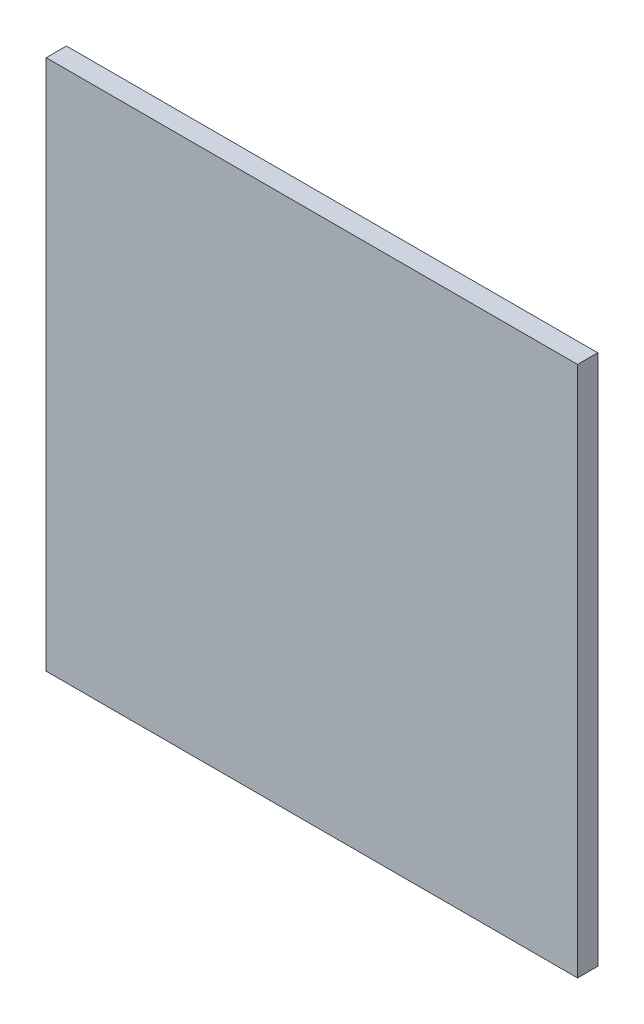
ISO-10303-21;
HEADER;
FILE_DESCRIPTION(('STEP AP214'),'2;1');
FILE_NAME('part.step','',(''),(''),'','','');
FILE_SCHEMA(('AUTOMOTIVE_DESIGN { 1 0 10303 214 1 1 1 1 }'));
ENDSEC;
DATA;
#1=APPLICATION_CONTEXT('core data for automotive mechanical design processes');
#2=APPLICATION_PROTOCOL_DEFINITION('international standard','automotive_design',2000,#1);
#3=PRODUCT_CONTEXT('',#1,'mechanical');
#4=PRODUCT('Part','Part','',(#3));
#5=PRODUCT_RELATED_PRODUCT_CATEGORY('part','',(#4));
#6=PRODUCT_DEFINITION_FORMATION('','',#4);
#7=PRODUCT_DEFINITION_CONTEXT('part definition',#1,'design');
#8=PRODUCT_DEFINITION('design','',#6,#7);
#9=PRODUCT_DEFINITION_SHAPE('','',#8);
#10=(LENGTH_UNIT() NAMED_UNIT(*) SI_UNIT(.MILLI.,.METRE.));
#11=(NAMED_UNIT(*) PLANE_ANGLE_UNIT() SI_UNIT($,.RADIAN.));
#12=(NAMED_UNIT(*) SI_UNIT($,.STERADIAN.) SOLID_ANGLE_UNIT());
#13=UNCERTAINTY_MEASURE_WITH_UNIT(LENGTH_MEASURE(1.E-05),#10,'distance_accuracy_value','');
#14=(GEOMETRIC_REPRESENTATION_CONTEXT(3) GLOBAL_UNCERTAINTY_ASSIGNED_CONTEXT((#13)) GLOBAL_UNIT_ASSIGNED_CONTEXT((#10,
#11,#12)) REPRESENTATION_CONTEXT('',''));
#15=CARTESIAN_POINT('',(0.,0.,0.));
#16=DIRECTION('',(0.,0.,1.));
#17=DIRECTION('',(1.,0.,0.));
#18=AXIS2_PLACEMENT_3D('',#15,#16,#17);
#19=CARTESIAN_POINT('',(0.,0.,0.));
#20=DIRECTION('',(0.,0.,-1.));
#21=DIRECTION('',(-1.,0.,0.));
#22=AXIS2_PLACEMENT_3D('',#19,#20,#21);
#23=PLANE('',#22);
#24=CARTESIAN_POINT('',(52.5,52.5,0.));
#25=DIRECTION('',(0.,0.,-1.));
#26=DIRECTION('',(-1.,0.,0.));
#27=AXIS2_PLACEMENT_3D('',#24,#25,#26);
#28=CIRCLE('',#27,3.);
#29=CARTESIAN_POINT('',(49.5,52.5,0.));
#30=VERTEX_POINT('',#29);
#31=EDGE_CURVE('E170',#30,#30,#28,.T.);
#32=ORIENTED_EDGE('',*,*,#31,.F.);
#33=EDGE_LOOP('',(#32));
#34=FACE_BOUND('',#33,.T.);
#35=DIRECTION('',(0.,-1.,0.));
#36=VECTOR('',#35,1.);
#37=CARTESIAN_POINT('',(0.,0.,0.));
#38=LINE('',#37,#36);
#39=CARTESIAN_POINT('',(0.,105.,0.));
#40=VERTEX_POINT('',#39);
#41=CARTESIAN_POINT('',(0.,0.,0.));
#42=VERTEX_POINT('',#41);
#43=EDGE_CURVE('E186',#40,#42,#38,.T.);
#44=ORIENTED_EDGE('',*,*,#43,.F.);
#45=DIRECTION('',(-1.,0.,0.));
#46=VECTOR('',#45,1.);
#47=CARTESIAN_POINT('',(0.,105.,0.));
#48=LINE('',#47,#46);
#49=CARTESIAN_POINT('',(105.,105.,0.));
#50=VERTEX_POINT('',#49);
#51=EDGE_CURVE('E193',#50,#40,#48,.T.);
#52=ORIENTED_EDGE('',*,*,#51,.F.);
#53=DIRECTION('',(0.,1.,0.));
#54=VECTOR('',#53,1.);
#55=CARTESIAN_POINT('',(105.,0.,0.));
#56=LINE('',#55,#54);
#57=CARTESIAN_POINT('',(105.,0.,0.));
#58=VERTEX_POINT('',#57);
#59=EDGE_CURVE('E208',#58,#50,#56,.T.);
#60=ORIENTED_EDGE('',*,*,#59,.F.);
#61=DIRECTION('',(1.,0.,0.));
#62=VECTOR('',#61,1.);
#63=CARTESIAN_POINT('',(0.,0.,0.));
#64=LINE('',#63,#62);
#65=EDGE_CURVE('E205',#42,#58,#64,.T.);
#66=ORIENTED_EDGE('',*,*,#65,.F.);
#67=EDGE_LOOP('',(#44,#52,#60,#66));
#68=FACE_BOUND('',#67,.T.);
#69=DIRECTION('',(-1.,0.,0.));
#70=VECTOR('',#69,1.);
#71=CARTESIAN_POINT('',(49.4405882918443,53.,0.));
#72=LINE('',#71,#70);
#73=CARTESIAN_POINT('',(49.4405882918443,53.,0.));
#74=VERTEX_POINT('',#73);
#75=CARTESIAN_POINT('',(40.,53.,0.));
#76=VERTEX_POINT('',#75);
#77=EDGE_CURVE('E276',#74,#76,#72,.T.);
#78=ORIENTED_EDGE('',*,*,#77,.F.);
#79=CARTESIAN_POINT('',(52.5,52.5,0.));
#80=DIRECTION('',(0.,0.,1.));
#81=DIRECTION('',(-1.,0.,0.));
#82=AXIS2_PLACEMENT_3D('',#79,#80,#81);
#83=CIRCLE('',#82,3.09999999999999);
#84=CARTESIAN_POINT('',(49.4405882918443,52.,0.));
#85=VERTEX_POINT('',#84);
#86=EDGE_CURVE('E167',#85,#74,#83,.T.);
#87=ORIENTED_EDGE('',*,*,#86,.F.);
#88=DIRECTION('',(1.,0.,0.));
#89=VECTOR('',#88,1.);
#90=CARTESIAN_POINT('',(49.4405882918443,52.,0.));
#91=LINE('',#90,#89);
#92=CARTESIAN_POINT('',(40.,52.,0.));
#93=VERTEX_POINT('',#92);
#94=EDGE_CURVE('E163',#93,#85,#91,.T.);
#95=ORIENTED_EDGE('',*,*,#94,.F.);
#96=DIRECTION('',(0.,1.,0.));
#97=VECTOR('',#96,1.);
#98=CARTESIAN_POINT('',(40.,50.,0.));
#99=LINE('',#98,#97);
#100=CARTESIAN_POINT('',(40.,50.,0.));
#101=VERTEX_POINT('',#100);
#102=EDGE_CURVE('E287',#101,#93,#99,.T.);
#103=ORIENTED_EDGE('',*,*,#102,.F.);
#104=DIRECTION('',(-1.,0.,0.));
#105=VECTOR('',#104,1.);
#106=CARTESIAN_POINT('',(46.5,50.,0.));
#107=LINE('',#106,#105);
#108=CARTESIAN_POINT('',(46.5,50.,0.));
#109=VERTEX_POINT('',#108);
#110=EDGE_CURVE('E260',#109,#101,#107,.T.);
#111=ORIENTED_EDGE('',*,*,#110,.F.);
#112=CARTESIAN_POINT('',(52.5,52.5,0.));
#113=DIRECTION('',(0.,0.,-1.));
#114=DIRECTION('',(-1.,0.,0.));
#115=AXIS2_PLACEMENT_3D('',#112,#113,#114);
#116=CIRCLE('',#115,6.50000000000001);
#117=CARTESIAN_POINT('',(46.5,55.,0.));
#118=VERTEX_POINT('',#117);
#119=EDGE_CURVE('E259',#118,#109,#116,.T.);
#120=ORIENTED_EDGE('',*,*,#119,.F.);
#121=DIRECTION('',(1.,0.,0.));
#122=VECTOR('',#121,1.);
#123=CARTESIAN_POINT('',(46.5,55.,0.));
#124=LINE('',#123,#122);
#125=CARTESIAN_POINT('',(40.,55.,0.));
#126=VERTEX_POINT('',#125);
#127=EDGE_CURVE('E261',#126,#118,#124,.T.);
#128=ORIENTED_EDGE('',*,*,#127,.F.);
#129=DIRECTION('',(0.,1.,0.));
#130=VECTOR('',#129,1.);
#131=CARTESIAN_POINT('',(40.,55.,0.));
#132=LINE('',#131,#130);
#133=EDGE_CURVE('E278',#76,#126,#132,.T.);
#134=ORIENTED_EDGE('',*,*,#133,.F.);
#135=EDGE_LOOP('',(#78,#87,#95,#103,#111,#120,#128,#134));
#136=FACE_BOUND('',#135,.T.);
#137=ADVANCED_FACE('F39',(#34,#68,#136),#23,.T.);
#138=CARTESIAN_POINT('',(0.,0.,4.));
#139=DIRECTION('',(1.,0.,0.));
#140=DIRECTION('',(0.,0.,-1.));
#141=AXIS2_PLACEMENT_3D('',#138,#139,#140);
#142=PLANE('',#141);
#143=ORIENTED_EDGE('',*,*,#43,.T.);
#144=DIRECTION('',(0.,0.,-1.));
#145=VECTOR('',#144,1.);
#146=CARTESIAN_POINT('',(0.,0.,4.));
#147=LINE('',#146,#145);
#148=CARTESIAN_POINT('',(0.,0.,4.));
#149=VERTEX_POINT('',#148);
#150=EDGE_CURVE('E224',#149,#42,#147,.T.);
#151=ORIENTED_EDGE('',*,*,#150,.F.);
#152=DIRECTION('',(0.,-1.,0.));
#153=VECTOR('',#152,1.);
#154=CARTESIAN_POINT('',(0.,0.,4.));
#155=LINE('',#154,#153);
#156=CARTESIAN_POINT('',(0.,105.,4.));
#157=VERTEX_POINT('',#156);
#158=EDGE_CURVE('E188',#157,#149,#155,.T.);
#159=ORIENTED_EDGE('',*,*,#158,.F.);
#160=DIRECTION('',(0.,0.,-1.));
#161=VECTOR('',#160,1.);
#162=CARTESIAN_POINT('',(0.,105.,4.));
#163=LINE('',#162,#161);
#164=EDGE_CURVE('E201',#157,#40,#163,.T.);
#165=ORIENTED_EDGE('',*,*,#164,.T.);
#166=EDGE_LOOP('',(#143,#151,#159,#165));
#167=FACE_BOUND('',#166,.T.);
#168=ADVANCED_FACE('F348',(#167),#142,.F.);
#169=CARTESIAN_POINT('',(0.,0.,4.));
#170=DIRECTION('',(0.,1.,0.));
#171=DIRECTION('',(0.,0.,1.));
#172=AXIS2_PLACEMENT_3D('',#169,#170,#171);
#173=PLANE('',#172);
#174=ORIENTED_EDGE('',*,*,#65,.T.);
#175=DIRECTION('',(0.,0.,-1.));
#176=VECTOR('',#175,1.);
#177=CARTESIAN_POINT('',(105.,0.,4.));
#178=LINE('',#177,#176);
#179=CARTESIAN_POINT('',(105.,0.,4.));
#180=VERTEX_POINT('',#179);
#181=EDGE_CURVE('E220',#180,#58,#178,.T.);
#182=ORIENTED_EDGE('',*,*,#181,.F.);
#183=DIRECTION('',(1.,0.,0.));
#184=VECTOR('',#183,1.);
#185=CARTESIAN_POINT('',(0.,0.,4.));
#186=LINE('',#185,#184);
#187=EDGE_CURVE('E192',#149,#180,#186,.T.);
#188=ORIENTED_EDGE('',*,*,#187,.F.);
#189=ORIENTED_EDGE('',*,*,#150,.T.);
#190=EDGE_LOOP('',(#174,#182,#188,#189));
#191=FACE_BOUND('',#190,.T.);
#192=ADVANCED_FACE('F354',(#191),#173,.F.);
#193=CARTESIAN_POINT('',(105.,0.,4.));
#194=DIRECTION('',(-1.,0.,0.));
#195=DIRECTION('',(0.,0.,1.));
#196=AXIS2_PLACEMENT_3D('',#193,#194,#195);
#197=PLANE('',#196);
#198=ORIENTED_EDGE('',*,*,#59,.T.);
#199=DIRECTION('',(0.,0.,-1.));
#200=VECTOR('',#199,1.);
#201=CARTESIAN_POINT('',(105.,105.,4.));
#202=LINE('',#201,#200);
#203=CARTESIAN_POINT('',(105.,105.,4.));
#204=VERTEX_POINT('',#203);
#205=EDGE_CURVE('E216',#204,#50,#202,.T.);
#206=ORIENTED_EDGE('',*,*,#205,.F.);
#207=DIRECTION('',(0.,1.,0.));
#208=VECTOR('',#207,1.);
#209=CARTESIAN_POINT('',(105.,0.,4.));
#210=LINE('',#209,#208);
#211=EDGE_CURVE('E196',#180,#204,#210,.T.);
#212=ORIENTED_EDGE('',*,*,#211,.F.);
#213=ORIENTED_EDGE('',*,*,#181,.T.);
#214=EDGE_LOOP('',(#198,#206,#212,#213));
#215=FACE_BOUND('',#214,.T.);
#216=ADVANCED_FACE('F366',(#215),#197,.F.);
#217=CARTESIAN_POINT('',(0.,105.,4.));
#218=DIRECTION('',(0.,-1.,0.));
#219=DIRECTION('',(0.,0.,-1.));
#220=AXIS2_PLACEMENT_3D('',#217,#218,#219);
#221=PLANE('',#220);
#222=ORIENTED_EDGE('',*,*,#51,.T.);
#223=ORIENTED_EDGE('',*,*,#164,.F.);
#224=DIRECTION('',(-1.,0.,0.));
#225=VECTOR('',#224,1.);
#226=CARTESIAN_POINT('',(0.,105.,4.));
#227=LINE('',#226,#225);
#228=EDGE_CURVE('E199',#204,#157,#227,.T.);
#229=ORIENTED_EDGE('',*,*,#228,.F.);
#230=ORIENTED_EDGE('',*,*,#205,.T.);
#231=EDGE_LOOP('',(#222,#223,#229,#230));
#232=FACE_BOUND('',#231,.T.);
#233=ADVANCED_FACE('F363',(#232),#221,.F.);
#234=CARTESIAN_POINT('',(0.,0.,4.));
#235=DIRECTION('',(0.,0.,-1.));
#236=DIRECTION('',(-1.,0.,0.));
#237=AXIS2_PLACEMENT_3D('',#234,#235,#236);
#238=PLANE('',#237);
#239=ORIENTED_EDGE('',*,*,#158,.T.);
#240=ORIENTED_EDGE('',*,*,#187,.T.);
#241=ORIENTED_EDGE('',*,*,#211,.T.);
#242=ORIENTED_EDGE('',*,*,#228,.T.);
#243=EDGE_LOOP('',(#239,#240,#241,#242));
#244=FACE_BOUND('',#243,.T.);
#245=ADVANCED_FACE('F361',(#244),#238,.F.);
#246=CARTESIAN_POINT('',(52.5,52.5,2.));
#247=DIRECTION('',(0.,0.,-1.));
#248=DIRECTION('',(-1.,0.,0.));
#249=AXIS2_PLACEMENT_3D('',#246,#247,#248);
#250=CYLINDRICAL_SURFACE('',#249,3.);
#251=CARTESIAN_POINT('',(52.5,52.5,2.));
#252=DIRECTION('',(0.,0.,-1.));
#253=DIRECTION('',(-1.,0.,0.));
#254=AXIS2_PLACEMENT_3D('',#251,#252,#253);
#255=CIRCLE('',#254,3.);
#256=CARTESIAN_POINT('',(49.5,52.5,2.));
#257=VERTEX_POINT('',#256);
#258=EDGE_CURVE('E177',#257,#257,#255,.T.);
#259=ORIENTED_EDGE('',*,*,#258,.F.);
#260=EDGE_LOOP('',(#259));
#261=FACE_BOUND('',#260,.T.);
#262=ORIENTED_EDGE('',*,*,#31,.T.);
#263=EDGE_LOOP('',(#262));
#264=FACE_BOUND('',#263,.T.);
#265=ADVANCED_FACE('F387',(#261,#264),#250,.F.);
#266=CARTESIAN_POINT('',(52.5,52.5,2.));
#267=DIRECTION('',(0.,0.,-1.));
#268=DIRECTION('',(-1.,0.,0.));
#269=AXIS2_PLACEMENT_3D('',#266,#267,#268);
#270=PLANE('',#269);
#271=ORIENTED_EDGE('',*,*,#258,.T.);
#272=EDGE_LOOP('',(#271));
#273=FACE_BOUND('',#272,.T.);
#274=ADVANCED_FACE('F391',(#273),#270,.T.);
#275=CARTESIAN_POINT('',(52.5,52.5,-12.));
#276=DIRECTION('',(0.,0.,1.));
#277=DIRECTION('',(1.,0.,0.));
#278=AXIS2_PLACEMENT_3D('',#275,#276,#277);
#279=CYLINDRICAL_SURFACE('',#278,3.09999999999999);
#280=ORIENTED_EDGE('',*,*,#86,.T.);
#281=DIRECTION('',(0.,0.,1.));
#282=VECTOR('',#281,1.);
#283=CARTESIAN_POINT('',(49.4405882918443,53.,-12.));
#284=LINE('',#283,#282);
#285=CARTESIAN_POINT('',(49.4405882918443,53.,-12.));
#286=VERTEX_POINT('',#285);
#287=EDGE_CURVE('E143',#286,#74,#284,.T.);
#288=ORIENTED_EDGE('',*,*,#287,.F.);
#289=CARTESIAN_POINT('',(52.5,52.5,-12.));
#290=DIRECTION('',(0.,0.,1.));
#291=DIRECTION('',(-1.,0.,0.));
#292=AXIS2_PLACEMENT_3D('',#289,#290,#291);
#293=CIRCLE('',#292,3.09999999999999);
#294=CARTESIAN_POINT('',(49.4405882918443,52.,-12.));
#295=VERTEX_POINT('',#294);
#296=EDGE_CURVE('E151',#295,#286,#293,.T.);
#297=ORIENTED_EDGE('',*,*,#296,.F.);
#298=DIRECTION('',(0.,0.,1.));
#299=VECTOR('',#298,1.);
#300=CARTESIAN_POINT('',(49.4405882918443,52.,-12.));
#301=LINE('',#300,#299);
#302=EDGE_CURVE('E267',#295,#85,#301,.T.);
#303=ORIENTED_EDGE('',*,*,#302,.T.);
#304=EDGE_LOOP('',(#280,#288,#297,#303));
#305=FACE_BOUND('',#304,.T.);
#306=ADVANCED_FACE('F165',(#305),#279,.F.);
#307=CARTESIAN_POINT('',(49.4405882918443,53.,-12.));
#308=DIRECTION('',(0.,1.,0.));
#309=DIRECTION('',(0.,0.,1.));
#310=AXIS2_PLACEMENT_3D('',#307,#308,#309);
#311=PLANE('',#310);
#312=CARTESIAN_POINT('',(43.25,53.,-6.));
#313=DIRECTION('',(0.,1.,0.));
#314=DIRECTION('',(0.,0.,1.));
#315=AXIS2_PLACEMENT_3D('',#312,#313,#314);
#316=CIRCLE('',#315,1.99870195498223);
#317=CARTESIAN_POINT('',(43.25,53.,-4.00129804501777));
#318=VERTEX_POINT('',#317);
#319=EDGE_CURVE('E255',#318,#318,#316,.T.);
#320=ORIENTED_EDGE('',*,*,#319,.T.);
#321=EDGE_LOOP('',(#320));
#322=FACE_BOUND('',#321,.T.);
#323=DIRECTION('',(0.,0.,1.));
#324=VECTOR('',#323,1.);
#325=CARTESIAN_POINT('',(40.,53.,-12.));
#326=LINE('',#325,#324);
#327=CARTESIAN_POINT('',(40.,53.,-11.));
#328=VERTEX_POINT('',#327);
#329=EDGE_CURVE('E171',#328,#76,#326,.T.);
#330=ORIENTED_EDGE('',*,*,#329,.F.);
#331=CARTESIAN_POINT('',(41.,53.,-11.));
#332=DIRECTION('',(0.,1.,0.));
#333=DIRECTION('',(0.,0.,1.));
#334=AXIS2_PLACEMENT_3D('',#331,#332,#333);
#335=CIRCLE('',#334,1.);
#336=CARTESIAN_POINT('',(41.,53.,-12.));
#337=VERTEX_POINT('',#336);
#338=EDGE_CURVE('E11',#328,#337,#335,.F.);
#339=ORIENTED_EDGE('',*,*,#338,.T.);
#340=DIRECTION('',(-1.,0.,0.));
#341=VECTOR('',#340,1.);
#342=CARTESIAN_POINT('',(49.4405882918443,53.,-12.));
#343=LINE('',#342,#341);
#344=EDGE_CURVE('E138',#286,#337,#343,.T.);
#345=ORIENTED_EDGE('',*,*,#344,.F.);
#346=ORIENTED_EDGE('',*,*,#287,.T.);
#347=ORIENTED_EDGE('',*,*,#77,.T.);
#348=EDGE_LOOP('',(#330,#339,#345,#346,#347));
#349=FACE_BOUND('',#348,.T.);
#350=ADVANCED_FACE('F140',(#322,#349),#311,.F.);
#351=CARTESIAN_POINT('',(40.,55.,-12.));
#352=DIRECTION('',(1.,0.,0.));
#353=DIRECTION('',(0.,1.,0.));
#354=AXIS2_PLACEMENT_3D('',#351,#352,#353);
#355=PLANE('',#354);
#356=DIRECTION('',(0.,0.,1.));
#357=VECTOR('',#356,1.);
#358=CARTESIAN_POINT('',(40.,55.,-12.));
#359=LINE('',#358,#357);
#360=CARTESIAN_POINT('',(40.,55.,-11.));
#361=VERTEX_POINT('',#360);
#362=EDGE_CURVE('E180',#361,#126,#359,.T.);
#363=ORIENTED_EDGE('',*,*,#362,.F.);
#364=DIRECTION('',(0.,1.,0.));
#365=VECTOR('',#364,1.);
#366=CARTESIAN_POINT('',(40.,53.,-11.));
#367=LINE('',#366,#365);
#368=EDGE_CURVE('E48',#361,#328,#367,.F.);
#369=ORIENTED_EDGE('',*,*,#368,.T.);
#370=ORIENTED_EDGE('',*,*,#329,.T.);
#371=ORIENTED_EDGE('',*,*,#133,.T.);
#372=EDGE_LOOP('',(#363,#369,#370,#371));
#373=FACE_BOUND('',#372,.T.);
#374=ADVANCED_FACE('F340',(#373),#355,.F.);
#375=CARTESIAN_POINT('',(46.5,55.,-12.));
#376=DIRECTION('',(0.,-1.,0.));
#377=DIRECTION('',(1.,0.,0.));
#378=AXIS2_PLACEMENT_3D('',#375,#376,#377);
#379=PLANE('',#378);
#380=CARTESIAN_POINT('',(43.25,55.,-6.));
#381=DIRECTION('',(0.,1.,0.));
#382=DIRECTION('',(0.,0.,1.));
#383=AXIS2_PLACEMENT_3D('',#380,#381,#382);
#384=CIRCLE('',#383,1.99870195498223);
#385=CARTESIAN_POINT('',(43.25,55.,-4.00129804501777));
#386=VERTEX_POINT('',#385);
#387=EDGE_CURVE('E234',#386,#386,#384,.T.);
#388=ORIENTED_EDGE('',*,*,#387,.F.);
#389=EDGE_LOOP('',(#388));
#390=FACE_BOUND('',#389,.T.);
#391=DIRECTION('',(1.,0.,0.));
#392=VECTOR('',#391,1.);
#393=CARTESIAN_POINT('',(46.5,55.,-12.));
#394=LINE('',#393,#392);
#395=CARTESIAN_POINT('',(41.,55.,-12.));
#396=VERTEX_POINT('',#395);
#397=CARTESIAN_POINT('',(46.5,55.,-12.));
#398=VERTEX_POINT('',#397);
#399=EDGE_CURVE('E150',#396,#398,#394,.T.);
#400=ORIENTED_EDGE('',*,*,#399,.F.);
#401=CARTESIAN_POINT('',(41.,55.,-11.));
#402=DIRECTION('',(0.,-1.,0.));
#403=DIRECTION('',(1.,0.,0.));
#404=AXIS2_PLACEMENT_3D('',#401,#402,#403);
#405=CIRCLE('',#404,1.);
#406=EDGE_CURVE('E62',#396,#361,#405,.F.);
#407=ORIENTED_EDGE('',*,*,#406,.T.);
#408=ORIENTED_EDGE('',*,*,#362,.T.);
#409=ORIENTED_EDGE('',*,*,#127,.T.);
#410=DIRECTION('',(0.,0.,1.));
#411=VECTOR('',#410,1.);
#412=CARTESIAN_POINT('',(46.5,55.,-12.));
#413=LINE('',#412,#411);
#414=EDGE_CURVE('E284',#398,#118,#413,.T.);
#415=ORIENTED_EDGE('',*,*,#414,.F.);
#416=EDGE_LOOP('',(#400,#407,#408,#409,#415));
#417=FACE_BOUND('',#416,.T.);
#418=ADVANCED_FACE('F339',(#390,#417),#379,.F.);
#419=CARTESIAN_POINT('',(52.5,52.5,-12.));
#420=DIRECTION('',(0.,0.,1.));
#421=DIRECTION('',(1.,0.,0.));
#422=AXIS2_PLACEMENT_3D('',#419,#420,#421);
#423=CYLINDRICAL_SURFACE('',#422,6.50000000000001);
#424=ORIENTED_EDGE('',*,*,#119,.T.);
#425=DIRECTION('',(0.,0.,1.));
#426=VECTOR('',#425,1.);
#427=CARTESIAN_POINT('',(46.5,50.,-12.));
#428=LINE('',#427,#426);
#429=CARTESIAN_POINT('',(46.5,50.,-12.));
#430=VERTEX_POINT('',#429);
#431=EDGE_CURVE('E282',#430,#109,#428,.T.);
#432=ORIENTED_EDGE('',*,*,#431,.F.);
#433=CARTESIAN_POINT('',(52.5,52.5,-12.));
#434=DIRECTION('',(0.,0.,-1.));
#435=DIRECTION('',(-1.,0.,0.));
#436=AXIS2_PLACEMENT_3D('',#433,#434,#435);
#437=CIRCLE('',#436,6.50000000000001);
#438=EDGE_CURVE('E269',#398,#430,#437,.T.);
#439=ORIENTED_EDGE('',*,*,#438,.F.);
#440=ORIENTED_EDGE('',*,*,#414,.T.);
#441=EDGE_LOOP('',(#424,#432,#439,#440));
#442=FACE_BOUND('',#441,.T.);
#443=ADVANCED_FACE('F336',(#442),#423,.T.);
#444=CARTESIAN_POINT('',(46.5,50.,-12.));
#445=DIRECTION('',(0.,1.,0.));
#446=DIRECTION('',(0.,0.,1.));
#447=AXIS2_PLACEMENT_3D('',#444,#445,#446);
#448=PLANE('',#447);
#449=CARTESIAN_POINT('',(43.25,50.,-6.));
#450=DIRECTION('',(0.,1.,0.));
#451=DIRECTION('',(0.,0.,1.));
#452=AXIS2_PLACEMENT_3D('',#449,#450,#451);
#453=CIRCLE('',#452,1.99870195498223);
#454=CARTESIAN_POINT('',(43.25,50.,-4.00129804501777));
#455=VERTEX_POINT('',#454);
#456=EDGE_CURVE('E233',#455,#455,#453,.T.);
#457=ORIENTED_EDGE('',*,*,#456,.T.);
#458=EDGE_LOOP('',(#457));
#459=FACE_BOUND('',#458,.T.);
#460=DIRECTION('',(0.,0.,1.));
#461=VECTOR('',#460,1.);
#462=CARTESIAN_POINT('',(40.,50.,-12.));
#463=LINE('',#462,#461);
#464=CARTESIAN_POINT('',(40.,50.,-11.));
#465=VERTEX_POINT('',#464);
#466=EDGE_CURVE('E266',#465,#101,#463,.T.);
#467=ORIENTED_EDGE('',*,*,#466,.F.);
#468=CARTESIAN_POINT('',(41.,50.,-11.));
#469=DIRECTION('',(0.,1.,0.));
#470=DIRECTION('',(0.,0.,1.));
#471=AXIS2_PLACEMENT_3D('',#468,#469,#470);
#472=CIRCLE('',#471,1.);
#473=CARTESIAN_POINT('',(41.,50.,-12.));
#474=VERTEX_POINT('',#473);
#475=EDGE_CURVE('E246',#465,#474,#472,.F.);
#476=ORIENTED_EDGE('',*,*,#475,.T.);
#477=DIRECTION('',(-1.,0.,0.));
#478=VECTOR('',#477,1.);
#479=CARTESIAN_POINT('',(46.5,50.,-12.));
#480=LINE('',#479,#478);
#481=EDGE_CURVE('E271',#430,#474,#480,.T.);
#482=ORIENTED_EDGE('',*,*,#481,.F.);
#483=ORIENTED_EDGE('',*,*,#431,.T.);
#484=ORIENTED_EDGE('',*,*,#110,.T.);
#485=EDGE_LOOP('',(#467,#476,#482,#483,#484));
#486=FACE_BOUND('',#485,.T.);
#487=ADVANCED_FACE('F324',(#459,#486),#448,.F.);
#488=CARTESIAN_POINT('',(40.,50.,-12.));
#489=DIRECTION('',(1.,0.,0.));
#490=DIRECTION('',(0.,0.,-1.));
#491=AXIS2_PLACEMENT_3D('',#488,#489,#490);
#492=PLANE('',#491);
#493=DIRECTION('',(0.,0.,1.));
#494=VECTOR('',#493,1.);
#495=CARTESIAN_POINT('',(40.,52.,-12.));
#496=LINE('',#495,#494);
#497=CARTESIAN_POINT('',(40.,52.,-11.));
#498=VERTEX_POINT('',#497);
#499=EDGE_CURVE('E264',#498,#93,#496,.T.);
#500=ORIENTED_EDGE('',*,*,#499,.F.);
#501=DIRECTION('',(0.,1.,0.));
#502=VECTOR('',#501,1.);
#503=CARTESIAN_POINT('',(40.,50.,-11.));
#504=LINE('',#503,#502);
#505=EDGE_CURVE('E243',#498,#465,#504,.F.);
#506=ORIENTED_EDGE('',*,*,#505,.T.);
#507=ORIENTED_EDGE('',*,*,#466,.T.);
#508=ORIENTED_EDGE('',*,*,#102,.T.);
#509=EDGE_LOOP('',(#500,#506,#507,#508));
#510=FACE_BOUND('',#509,.T.);
#511=ADVANCED_FACE('F317',(#510),#492,.F.);
#512=CARTESIAN_POINT('',(49.4405882918443,52.,-12.));
#513=DIRECTION('',(0.,-1.,0.));
#514=DIRECTION('',(0.,0.,-1.));
#515=AXIS2_PLACEMENT_3D('',#512,#513,#514);
#516=PLANE('',#515);
#517=CARTESIAN_POINT('',(43.25,52.,-6.));
#518=DIRECTION('',(0.,-1.,0.));
#519=DIRECTION('',(0.,0.,-1.));
#520=AXIS2_PLACEMENT_3D('',#517,#518,#519);
#521=CIRCLE('',#520,1.99870195498223);
#522=CARTESIAN_POINT('',(43.25,52.,-7.99870195498223));
#523=VERTEX_POINT('',#522);
#524=EDGE_CURVE('E229',#523,#523,#521,.T.);
#525=ORIENTED_EDGE('',*,*,#524,.T.);
#526=EDGE_LOOP('',(#525));
#527=FACE_BOUND('',#526,.T.);
#528=DIRECTION('',(1.,0.,0.));
#529=VECTOR('',#528,1.);
#530=CARTESIAN_POINT('',(49.4405882918443,52.,-12.));
#531=LINE('',#530,#529);
#532=CARTESIAN_POINT('',(41.,52.,-12.));
#533=VERTEX_POINT('',#532);
#534=EDGE_CURVE('E158',#533,#295,#531,.T.);
#535=ORIENTED_EDGE('',*,*,#534,.F.);
#536=CARTESIAN_POINT('',(41.,52.,-11.));
#537=DIRECTION('',(0.,-1.,0.));
#538=DIRECTION('',(0.,0.,-1.));
#539=AXIS2_PLACEMENT_3D('',#536,#537,#538);
#540=CIRCLE('',#539,1.);
#541=EDGE_CURVE('E240',#533,#498,#540,.F.);
#542=ORIENTED_EDGE('',*,*,#541,.T.);
#543=ORIENTED_EDGE('',*,*,#499,.T.);
#544=ORIENTED_EDGE('',*,*,#94,.T.);
#545=ORIENTED_EDGE('',*,*,#302,.F.);
#546=EDGE_LOOP('',(#535,#542,#543,#544,#545));
#547=FACE_BOUND('',#546,.T.);
#548=ADVANCED_FACE('F330',(#527,#547),#516,.F.);
#549=CARTESIAN_POINT('',(52.5,52.5,-12.));
#550=DIRECTION('',(0.,0.,-1.));
#551=DIRECTION('',(-1.,0.,0.));
#552=AXIS2_PLACEMENT_3D('',#549,#550,#551);
#553=PLANE('',#552);
#554=ORIENTED_EDGE('',*,*,#481,.T.);
#555=DIRECTION('',(0.,1.,0.));
#556=VECTOR('',#555,1.);
#557=CARTESIAN_POINT('',(41.,52.,-12.));
#558=LINE('',#557,#556);
#559=EDGE_CURVE('E237',#474,#533,#558,.T.);
#560=ORIENTED_EDGE('',*,*,#559,.T.);
#561=ORIENTED_EDGE('',*,*,#534,.T.);
#562=ORIENTED_EDGE('',*,*,#296,.T.);
#563=ORIENTED_EDGE('',*,*,#344,.T.);
#564=DIRECTION('',(0.,1.,0.));
#565=VECTOR('',#564,1.);
#566=CARTESIAN_POINT('',(41.,55.,-12.));
#567=LINE('',#566,#565);
#568=EDGE_CURVE('E228',#337,#396,#567,.T.);
#569=ORIENTED_EDGE('',*,*,#568,.T.);
#570=ORIENTED_EDGE('',*,*,#399,.T.);
#571=ORIENTED_EDGE('',*,*,#438,.T.);
#572=EDGE_LOOP('',(#554,#560,#561,#562,#563,#569,#570,#571));
#573=FACE_BOUND('',#572,.T.);
#574=ADVANCED_FACE('F155',(#573),#553,.T.);
#575=CARTESIAN_POINT('',(43.25,43.,-6.));
#576=DIRECTION('',(0.,1.,0.));
#577=DIRECTION('',(0.,0.,1.));
#578=AXIS2_PLACEMENT_3D('',#575,#576,#577);
#579=CYLINDRICAL_SURFACE('',#578,1.99870195498223);
#580=ORIENTED_EDGE('',*,*,#524,.F.);
#581=EDGE_LOOP('',(#580));
#582=FACE_BOUND('',#581,.T.);
#583=ORIENTED_EDGE('',*,*,#456,.F.);
#584=EDGE_LOOP('',(#583));
#585=FACE_BOUND('',#584,.T.);
#586=ADVANCED_FACE('F423',(#582,#585),#579,.F.);
#587=ORIENTED_EDGE('',*,*,#387,.T.);
#588=EDGE_LOOP('',(#587));
#589=FACE_BOUND('',#588,.T.);
#590=ORIENTED_EDGE('',*,*,#319,.F.);
#591=EDGE_LOOP('',(#590));
#592=FACE_BOUND('',#591,.T.);
#593=ADVANCED_FACE('F346',(#589,#592),#579,.F.);
#594=CARTESIAN_POINT('',(41.,52.5,-11.));
#595=DIRECTION('',(0.,-1.,0.));
#596=DIRECTION('',(0.,0.,-1.));
#597=AXIS2_PLACEMENT_3D('',#594,#595,#596);
#598=CYLINDRICAL_SURFACE('',#597,1.);
#599=ORIENTED_EDGE('',*,*,#475,.F.);
#600=ORIENTED_EDGE('',*,*,#505,.F.);
#601=ORIENTED_EDGE('',*,*,#541,.F.);
#602=ORIENTED_EDGE('',*,*,#559,.F.);
#603=EDGE_LOOP('',(#599,#600,#601,#602));
#604=FACE_BOUND('',#603,.T.);
#605=ADVANCED_FACE('F332',(#604),#598,.T.);
#606=CARTESIAN_POINT('',(41.,52.5,-11.));
#607=DIRECTION('',(0.,-1.,0.));
#608=DIRECTION('',(1.,0.,0.));
#609=AXIS2_PLACEMENT_3D('',#606,#607,#608);
#610=CYLINDRICAL_SURFACE('',#609,1.);
#611=ORIENTED_EDGE('',*,*,#338,.F.);
#612=ORIENTED_EDGE('',*,*,#368,.F.);
#613=ORIENTED_EDGE('',*,*,#406,.F.);
#614=ORIENTED_EDGE('',*,*,#568,.F.);
#615=EDGE_LOOP('',(#611,#612,#613,#614));
#616=FACE_BOUND('',#615,.T.);
#617=ADVANCED_FACE('F41',(#616),#610,.T.);
#618=CLOSED_SHELL('',(#137,#168,#192,#216,#233,#245,#265,#274,#306,#350,#374,#418,#443,#487,
#511,#548,#574,#586,#593,#605,#617));
#619=MANIFOLD_SOLID_BREP('B2',#618);
#620=ADVANCED_BREP_SHAPE_REPRESENTATION('',(#18,#619),#14);
#621=SHAPE_DEFINITION_REPRESENTATION(#9,#620);
ENDSEC;
END-ISO-10303-21;
